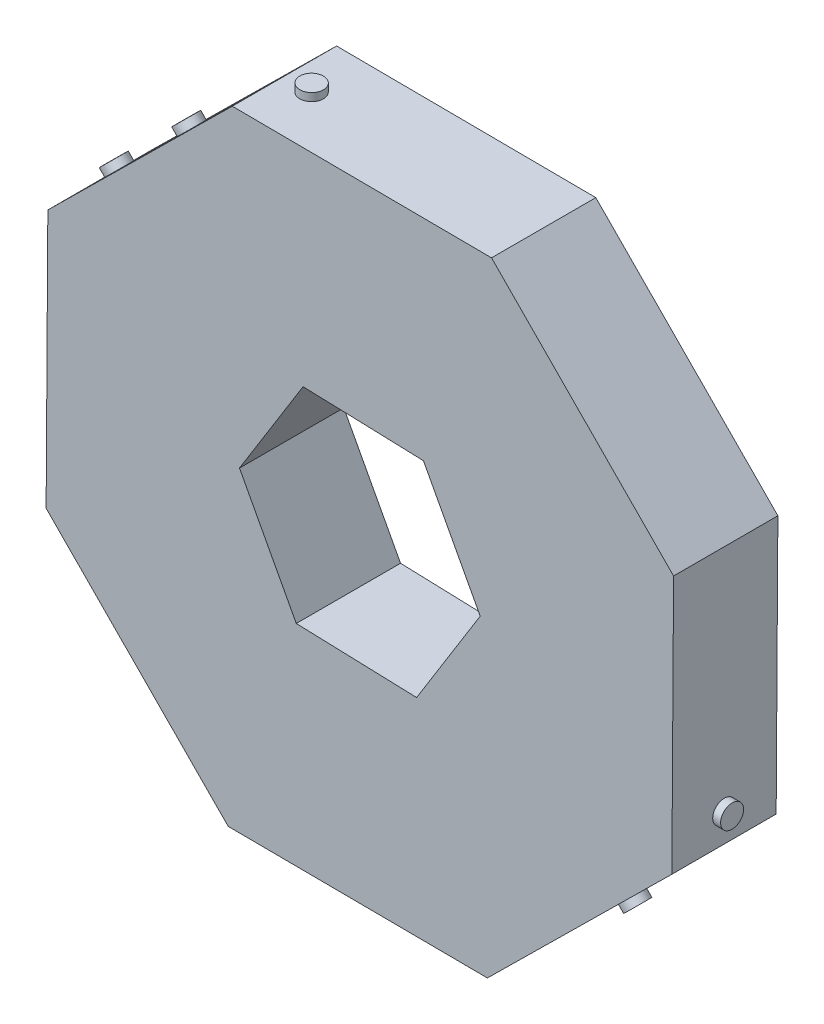
ISO-10303-21;
HEADER;
FILE_DESCRIPTION(('STEP AP214'),'2;1');
FILE_NAME('part.step','',(''),(''),'','','');
FILE_SCHEMA(('AUTOMOTIVE_DESIGN { 1 0 10303 214 1 1 1 1 }'));
ENDSEC;
DATA;
#1=APPLICATION_CONTEXT('core data for automotive mechanical design processes');
#2=APPLICATION_PROTOCOL_DEFINITION('international standard','automotive_design',2000,#1);
#3=PRODUCT_CONTEXT('',#1,'mechanical');
#4=PRODUCT('Part','Part','',(#3));
#5=PRODUCT_RELATED_PRODUCT_CATEGORY('part','',(#4));
#6=PRODUCT_DEFINITION_FORMATION('','',#4);
#7=PRODUCT_DEFINITION_CONTEXT('part definition',#1,'design');
#8=PRODUCT_DEFINITION('design','',#6,#7);
#9=PRODUCT_DEFINITION_SHAPE('','',#8);
#10=(LENGTH_UNIT() NAMED_UNIT(*) SI_UNIT(.MILLI.,.METRE.));
#11=(NAMED_UNIT(*) PLANE_ANGLE_UNIT() SI_UNIT($,.RADIAN.));
#12=(NAMED_UNIT(*) SI_UNIT($,.STERADIAN.) SOLID_ANGLE_UNIT());
#13=UNCERTAINTY_MEASURE_WITH_UNIT(LENGTH_MEASURE(1.E-05),#10,'distance_accuracy_value','');
#14=(GEOMETRIC_REPRESENTATION_CONTEXT(3) GLOBAL_UNCERTAINTY_ASSIGNED_CONTEXT((#13)) GLOBAL_UNIT_ASSIGNED_CONTEXT((#10,
#11,#12)) REPRESENTATION_CONTEXT('',''));
#15=CARTESIAN_POINT('',(0.,0.,0.));
#16=DIRECTION('',(0.,0.,1.));
#17=DIRECTION('',(1.,0.,0.));
#18=AXIS2_PLACEMENT_3D('',#15,#16,#17);
#19=CARTESIAN_POINT('',(8.01629438391465,18.9975195673597,6.35));
#20=DIRECTION('',(-0.00659830947412468,-0.999978230919095,0.));
#21=DIRECTION('',(0.999978230919095,-0.00659830947412468,0.));
#22=AXIS2_PLACEMENT_3D('',#19,#20,#21);
#23=PLANE('',#22);
#24=CARTESIAN_POINT('',(-6.11393473370306,19.0907572217161,3.175));
#25=DIRECTION('',(-0.00659830947412468,-0.999978230919095,0.));
#26=DIRECTION('',(0.999978230919095,-0.00659830947412468,0.));
#27=AXIS2_PLACEMENT_3D('',#24,#25,#26);
#28=CIRCLE('',#27,0.719999999999999);
#29=CARTESIAN_POINT('',(-5.39395040744131,19.0860064388947,3.175));
#30=VERTEX_POINT('',#29);
#31=EDGE_CURVE('E339',#30,#30,#28,.F.);
#32=ORIENTED_EDGE('',*,*,#31,.F.);
#33=EDGE_LOOP('',(#32));
#34=FACE_BOUND('',#33,.T.);
#35=DIRECTION('',(-0.999978230919096,0.00659830947412468,0.));
#36=VECTOR('',#35,1.);
#37=CARTESIAN_POINT('',(8.01629438391465,18.9975195673597,0.));
#38=LINE('',#37,#36);
#39=CARTESIAN_POINT('',(8.01629438391465,18.9975195673597,0.));
#40=VERTEX_POINT('',#39);
#41=CARTESIAN_POINT('',(-7.76489879295049,19.1016510306578,0.));
#42=VERTEX_POINT('',#41);
#43=EDGE_CURVE('E257',#40,#42,#38,.T.);
#44=ORIENTED_EDGE('',*,*,#43,.T.);
#45=DIRECTION('',(0.,0.,-1.));
#46=VECTOR('',#45,1.);
#47=CARTESIAN_POINT('',(-7.76489879295049,19.1016510306578,6.35));
#48=LINE('',#47,#46);
#49=CARTESIAN_POINT('',(-7.76489879295049,19.1016510306578,6.35));
#50=VERTEX_POINT('',#49);
#51=EDGE_CURVE('E335',#50,#42,#48,.T.);
#52=ORIENTED_EDGE('',*,*,#51,.F.);
#53=DIRECTION('',(-0.999978230919096,0.00659830947412468,0.));
#54=VECTOR('',#53,1.);
#55=CARTESIAN_POINT('',(8.01629438391465,18.9975195673597,6.35));
#56=LINE('',#55,#54);
#57=CARTESIAN_POINT('',(8.01629438391465,18.9975195673597,6.35));
#58=VERTEX_POINT('',#57);
#59=EDGE_CURVE('E258',#58,#50,#56,.T.);
#60=ORIENTED_EDGE('',*,*,#59,.F.);
#61=DIRECTION('',(0.,0.,-1.));
#62=VECTOR('',#61,1.);
#63=CARTESIAN_POINT('',(8.01629438391465,18.9975195673597,6.35));
#64=LINE('',#63,#62);
#65=EDGE_CURVE('E284',#58,#40,#64,.T.);
#66=ORIENTED_EDGE('',*,*,#65,.T.);
#67=EDGE_LOOP('',(#44,#52,#60,#66));
#68=FACE_BOUND('',#67,.T.);
#69=ADVANCED_FACE('F38',(#34,#68),#23,.F.);
#70=CARTESIAN_POINT('',(-7.76489879295049,19.1016510306578,6.35));
#71=DIRECTION('',(0.702425678748299,-0.711757097495341,0.));
#72=DIRECTION('',(0.711757097495341,0.702425678748299,0.));
#73=AXIS2_PLACEMENT_3D('',#70,#71,#72);
#74=PLANE('',#73);
#75=CARTESIAN_POINT('',(-13.4095145949238,13.5310383877675,3.175));
#76=DIRECTION('',(0.702425678748299,-0.711757097495341,0.));
#77=DIRECTION('',(0.711757097495341,0.702425678748299,0.));
#78=AXIS2_PLACEMENT_3D('',#75,#76,#77);
#79=CIRCLE('',#78,0.720000000000001);
#80=CARTESIAN_POINT('',(-12.8970494847271,14.0367848764663,3.175));
#81=VERTEX_POINT('',#80);
#82=EDGE_CURVE('E347',#81,#81,#79,.F.);
#83=ORIENTED_EDGE('',*,*,#82,.F.);
#84=EDGE_LOOP('',(#83));
#85=FACE_BOUND('',#84,.T.);
#86=CARTESIAN_POINT('',(-17.8224085993949,9.17599917952807,3.175));
#87=DIRECTION('',(0.702425678748299,-0.711757097495341,0.));
#88=DIRECTION('',(0.711757097495341,0.702425678748299,0.));
#89=AXIS2_PLACEMENT_3D('',#86,#87,#88);
#90=CIRCLE('',#89,0.719999999999999);
#91=CARTESIAN_POINT('',(-17.3099434891982,9.68174566822685,3.175));
#92=VERTEX_POINT('',#91);
#93=EDGE_CURVE('E343',#92,#92,#90,.F.);
#94=ORIENTED_EDGE('',*,*,#93,.F.);
#95=EDGE_LOOP('',(#94));
#96=FACE_BOUND('',#95,.T.);
#97=DIRECTION('',(-0.711757097495341,-0.702425678748299,0.));
#98=VECTOR('',#97,1.);
#99=CARTESIAN_POINT('',(-7.76489879295049,19.1016510306578,0.));
#100=LINE('',#99,#98);
#101=CARTESIAN_POINT('',(-18.9975195673597,8.01629438391463,0.));
#102=VERTEX_POINT('',#101);
#103=EDGE_CURVE('E288',#42,#102,#100,.T.);
#104=ORIENTED_EDGE('',*,*,#103,.T.);
#105=DIRECTION('',(0.,0.,-1.));
#106=VECTOR('',#105,1.);
#107=CARTESIAN_POINT('',(-18.9975195673597,8.01629438391463,6.35));
#108=LINE('',#107,#106);
#109=CARTESIAN_POINT('',(-18.9975195673597,8.01629438391463,6.35));
#110=VERTEX_POINT('',#109);
#111=EDGE_CURVE('E331',#110,#102,#108,.T.);
#112=ORIENTED_EDGE('',*,*,#111,.F.);
#113=DIRECTION('',(-0.711757097495341,-0.702425678748299,0.));
#114=VECTOR('',#113,1.);
#115=CARTESIAN_POINT('',(-7.76489879295049,19.1016510306578,6.35));
#116=LINE('',#115,#114);
#117=EDGE_CURVE('E262',#50,#110,#116,.T.);
#118=ORIENTED_EDGE('',*,*,#117,.F.);
#119=ORIENTED_EDGE('',*,*,#51,.T.);
#120=EDGE_LOOP('',(#104,#112,#118,#119));
#121=FACE_BOUND('',#120,.T.);
#122=ADVANCED_FACE('F424',(#85,#96,#121),#74,.F.);
#123=CARTESIAN_POINT('',(-18.9975195673597,8.01629438391463,6.35));
#124=DIRECTION('',(0.999978230919095,-0.00659830947412469,0.));
#125=DIRECTION('',(0.00659830947412469,0.999978230919095,0.));
#126=AXIS2_PLACEMENT_3D('',#123,#124,#125);
#127=PLANE('',#126);
#128=CARTESIAN_POINT('',(-19.0084103683065,6.36578618832834,3.175));
#129=DIRECTION('',(0.999978230919095,-0.00659830947412469,0.));
#130=DIRECTION('',(0.00659830947412469,0.999978230919095,0.));
#131=AXIS2_PLACEMENT_3D('',#128,#129,#130);
#132=CIRCLE('',#131,0.72);
#133=CARTESIAN_POINT('',(-19.0036595854851,7.08577051459009,3.175));
#134=VERTEX_POINT('',#133);
#135=EDGE_CURVE('E359',#134,#134,#132,.F.);
#136=ORIENTED_EDGE('',*,*,#135,.F.);
#137=EDGE_LOOP('',(#136));
#138=FACE_BOUND('',#137,.T.);
#139=CARTESIAN_POINT('',(-19.049583819425,0.125922027393186,3.175));
#140=DIRECTION('',(0.999978230919095,-0.00659830947412469,0.));
#141=DIRECTION('',(0.00659830947412469,0.999978230919095,0.));
#142=AXIS2_PLACEMENT_3D('',#139,#140,#141);
#143=CIRCLE('',#142,0.72);
#144=CARTESIAN_POINT('',(-19.0448330366036,0.845906353654935,3.175));
#145=VERTEX_POINT('',#144);
#146=EDGE_CURVE('E355',#145,#145,#143,.F.);
#147=ORIENTED_EDGE('',*,*,#146,.F.);
#148=EDGE_LOOP('',(#147));
#149=FACE_BOUND('',#148,.T.);
#150=CARTESIAN_POINT('',(-19.0907572217161,-6.11393473370306,3.175));
#151=DIRECTION('',(0.999978230919095,-0.00659830947412469,0.));
#152=DIRECTION('',(0.00659830947412469,0.999978230919095,0.));
#153=AXIS2_PLACEMENT_3D('',#150,#151,#152);
#154=CIRCLE('',#153,0.72);
#155=CARTESIAN_POINT('',(-19.0860064388947,-5.39395040744131,3.175));
#156=VERTEX_POINT('',#155);
#157=EDGE_CURVE('E351',#156,#156,#154,.F.);
#158=ORIENTED_EDGE('',*,*,#157,.F.);
#159=EDGE_LOOP('',(#158));
#160=FACE_BOUND('',#159,.T.);
#161=DIRECTION('',(-0.00659830947412468,-0.999978230919095,0.));
#162=VECTOR('',#161,1.);
#163=CARTESIAN_POINT('',(-18.9975195673597,8.01629438391463,0.));
#164=LINE('',#163,#162);
#165=CARTESIAN_POINT('',(-19.1016510306578,-7.76489879295049,0.));
#166=VERTEX_POINT('',#165);
#167=EDGE_CURVE('E291',#102,#166,#164,.T.);
#168=ORIENTED_EDGE('',*,*,#167,.T.);
#169=DIRECTION('',(0.,0.,-1.));
#170=VECTOR('',#169,1.);
#171=CARTESIAN_POINT('',(-19.1016510306578,-7.76489879295049,6.35));
#172=LINE('',#171,#170);
#173=CARTESIAN_POINT('',(-19.1016510306578,-7.76489879295049,6.35));
#174=VERTEX_POINT('',#173);
#175=EDGE_CURVE('E327',#174,#166,#172,.T.);
#176=ORIENTED_EDGE('',*,*,#175,.F.);
#177=DIRECTION('',(-0.00659830947412468,-0.999978230919095,0.));
#178=VECTOR('',#177,1.);
#179=CARTESIAN_POINT('',(-18.9975195673597,8.01629438391463,6.35));
#180=LINE('',#179,#178);
#181=EDGE_CURVE('E266',#110,#174,#180,.T.);
#182=ORIENTED_EDGE('',*,*,#181,.F.);
#183=ORIENTED_EDGE('',*,*,#111,.T.);
#184=EDGE_LOOP('',(#168,#176,#182,#183));
#185=FACE_BOUND('',#184,.T.);
#186=ADVANCED_FACE('F422',(#138,#149,#160,#185),#127,.F.);
#187=CARTESIAN_POINT('',(-19.1016510306578,-7.76489879295049,6.35));
#188=DIRECTION('',(0.711757097495341,0.702425678748299,0.));
#189=DIRECTION('',(-0.702425678748299,0.711757097495341,0.));
#190=AXIS2_PLACEMENT_3D('',#187,#188,#189);
#191=PLANE('',#190);
#192=CARTESIAN_POINT('',(-17.886077596007,-8.99662059045266,3.175));
#193=DIRECTION('',(0.711757097495341,0.702425678748299,0.));
#194=DIRECTION('',(-0.702425678748299,0.711757097495341,0.));
#195=AXIS2_PLACEMENT_3D('',#192,#193,#194);
#196=CIRCLE('',#195,0.7);
#197=CARTESIAN_POINT('',(-18.3777755711308,-8.49839062220592,3.175));
#198=VERTEX_POINT('',#197);
#199=EDGE_CURVE('E367',#198,#198,#196,.F.);
#200=ORIENTED_EDGE('',*,*,#199,.F.);
#201=EDGE_LOOP('',(#200));
#202=FACE_BOUND('',#201,.T.);
#203=CARTESIAN_POINT('',(-9.17599917952807,-17.8224085993949,3.175));
#204=DIRECTION('',(0.711757097495341,0.702425678748299,0.));
#205=DIRECTION('',(-0.702425678748299,0.711757097495341,0.));
#206=AXIS2_PLACEMENT_3D('',#203,#204,#205);
#207=CIRCLE('',#206,0.7);
#208=CARTESIAN_POINT('',(-9.66769715465188,-17.3241786311482,3.175));
#209=VERTEX_POINT('',#208);
#210=EDGE_CURVE('E363',#209,#209,#207,.F.);
#211=ORIENTED_EDGE('',*,*,#210,.F.);
#212=EDGE_LOOP('',(#211));
#213=FACE_BOUND('',#212,.T.);
#214=DIRECTION('',(0.702425678748299,-0.711757097495341,0.));
#215=VECTOR('',#214,1.);
#216=CARTESIAN_POINT('',(-19.1016510306578,-7.76489879295049,0.));
#217=LINE('',#216,#215);
#218=CARTESIAN_POINT('',(-8.01629438391464,-18.9975195673597,0.));
#219=VERTEX_POINT('',#218);
#220=EDGE_CURVE('E294',#166,#219,#217,.T.);
#221=ORIENTED_EDGE('',*,*,#220,.T.);
#222=DIRECTION('',(0.,0.,-1.));
#223=VECTOR('',#222,1.);
#224=CARTESIAN_POINT('',(-8.01629438391464,-18.9975195673597,6.35));
#225=LINE('',#224,#223);
#226=CARTESIAN_POINT('',(-8.01629438391464,-18.9975195673597,6.35));
#227=VERTEX_POINT('',#226);
#228=EDGE_CURVE('E323',#227,#219,#225,.T.);
#229=ORIENTED_EDGE('',*,*,#228,.F.);
#230=DIRECTION('',(0.702425678748299,-0.711757097495341,0.));
#231=VECTOR('',#230,1.);
#232=CARTESIAN_POINT('',(-19.1016510306578,-7.76489879295049,6.35));
#233=LINE('',#232,#231);
#234=EDGE_CURVE('E269',#174,#227,#233,.T.);
#235=ORIENTED_EDGE('',*,*,#234,.F.);
#236=ORIENTED_EDGE('',*,*,#175,.T.);
#237=EDGE_LOOP('',(#221,#229,#235,#236));
#238=FACE_BOUND('',#237,.T.);
#239=ADVANCED_FACE('F418',(#202,#213,#238),#191,.F.);
#240=CARTESIAN_POINT('',(-8.01629438391464,-18.9975195673597,6.35));
#241=DIRECTION('',(0.00659830947412468,0.999978230919095,0.));
#242=DIRECTION('',(-0.999978230919095,0.00659830947412468,0.));
#243=AXIS2_PLACEMENT_3D('',#240,#241,#242);
#244=PLANE('',#243);
#245=CARTESIAN_POINT('',(-6.28579532969371,-19.0089381842369,3.175));
#246=DIRECTION('',(0.00659830947412468,0.999978230919095,0.));
#247=DIRECTION('',(-0.999978230919095,0.00659830947412468,0.));
#248=AXIS2_PLACEMENT_3D('',#245,#246,#247);
#249=CIRCLE('',#248,0.700000000000001);
#250=CARTESIAN_POINT('',(-6.98578009133708,-19.004319367605,3.175));
#251=VERTEX_POINT('',#250);
#252=EDGE_CURVE('E375',#251,#251,#249,.F.);
#253=ORIENTED_EDGE('',*,*,#252,.F.);
#254=EDGE_LOOP('',(#253));
#255=FACE_BOUND('',#254,.T.);
#256=CARTESIAN_POINT('',(-0.0859302979953177,-19.0498477029765,3.175));
#257=DIRECTION('',(0.00659830947412468,0.999978230919095,0.));
#258=DIRECTION('',(-0.999978230919095,0.00659830947412468,0.));
#259=AXIS2_PLACEMENT_3D('',#256,#257,#258);
#260=CIRCLE('',#259,0.7);
#261=CARTESIAN_POINT('',(-0.785915059638684,-19.0452288863446,3.175));
#262=VERTEX_POINT('',#261);
#263=EDGE_CURVE('E371',#262,#262,#260,.F.);
#264=ORIENTED_EDGE('',*,*,#263,.F.);
#265=EDGE_LOOP('',(#264));
#266=FACE_BOUND('',#265,.T.);
#267=DIRECTION('',(0.999978230919096,-0.00659830947412468,0.));
#268=VECTOR('',#267,1.);
#269=CARTESIAN_POINT('',(-8.01629438391464,-18.9975195673597,0.));
#270=LINE('',#269,#268);
#271=CARTESIAN_POINT('',(7.7648987929505,-19.1016510306578,0.));
#272=VERTEX_POINT('',#271);
#273=EDGE_CURVE('E297',#219,#272,#270,.T.);
#274=ORIENTED_EDGE('',*,*,#273,.T.);
#275=DIRECTION('',(0.,0.,-1.));
#276=VECTOR('',#275,1.);
#277=CARTESIAN_POINT('',(7.7648987929505,-19.1016510306578,6.35));
#278=LINE('',#277,#276);
#279=CARTESIAN_POINT('',(7.7648987929505,-19.1016510306578,6.35));
#280=VERTEX_POINT('',#279);
#281=EDGE_CURVE('E319',#280,#272,#278,.T.);
#282=ORIENTED_EDGE('',*,*,#281,.F.);
#283=DIRECTION('',(0.999978230919096,-0.00659830947412468,0.));
#284=VECTOR('',#283,1.);
#285=CARTESIAN_POINT('',(-8.01629438391464,-18.9975195673597,6.35));
#286=LINE('',#285,#284);
#287=EDGE_CURVE('E272',#227,#280,#286,.T.);
#288=ORIENTED_EDGE('',*,*,#287,.F.);
#289=ORIENTED_EDGE('',*,*,#228,.T.);
#290=EDGE_LOOP('',(#274,#282,#288,#289));
#291=FACE_BOUND('',#290,.T.);
#292=ADVANCED_FACE('F388',(#255,#266,#291),#244,.F.);
#293=CARTESIAN_POINT('',(7.7648987929505,-19.1016510306578,6.35));
#294=DIRECTION('',(-0.702425678748299,0.711757097495341,0.));
#295=DIRECTION('',(-0.711757097495341,-0.702425678748299,0.));
#296=AXIS2_PLACEMENT_3D('',#293,#294,#295);
#297=PLANE('',#296);
#298=CARTESIAN_POINT('',(13.4095145949238,-13.5310383877675,3.175));
#299=DIRECTION('',(-0.702425678748299,0.711757097495341,0.));
#300=DIRECTION('',(-0.711757097495341,-0.702425678748299,0.));
#301=AXIS2_PLACEMENT_3D('',#298,#299,#300);
#302=CIRCLE('',#301,0.699999999999999);
#303=CARTESIAN_POINT('',(12.911284626677,-14.0227363628913,3.175));
#304=VERTEX_POINT('',#303);
#305=EDGE_CURVE('E46',#304,#304,#302,.F.);
#306=ORIENTED_EDGE('',*,*,#305,.F.);
#307=EDGE_LOOP('',(#306));
#308=FACE_BOUND('',#307,.T.);
#309=DIRECTION('',(0.71175709749534,0.702425678748299,0.));
#310=VECTOR('',#309,1.);
#311=CARTESIAN_POINT('',(7.7648987929505,-19.1016510306578,0.));
#312=LINE('',#311,#310);
#313=CARTESIAN_POINT('',(18.9975195673597,-8.01629438391464,0.));
#314=VERTEX_POINT('',#313);
#315=EDGE_CURVE('E300',#272,#314,#312,.T.);
#316=ORIENTED_EDGE('',*,*,#315,.T.);
#317=DIRECTION('',(0.,0.,-1.));
#318=VECTOR('',#317,1.);
#319=CARTESIAN_POINT('',(18.9975195673597,-8.01629438391464,6.35));
#320=LINE('',#319,#318);
#321=CARTESIAN_POINT('',(18.9975195673597,-8.01629438391464,6.35));
#322=VERTEX_POINT('',#321);
#323=EDGE_CURVE('E315',#322,#314,#320,.T.);
#324=ORIENTED_EDGE('',*,*,#323,.F.);
#325=DIRECTION('',(0.71175709749534,0.702425678748299,0.));
#326=VECTOR('',#325,1.);
#327=CARTESIAN_POINT('',(7.7648987929505,-19.1016510306578,6.35));
#328=LINE('',#327,#326);
#329=EDGE_CURVE('E275',#280,#322,#328,.T.);
#330=ORIENTED_EDGE('',*,*,#329,.F.);
#331=ORIENTED_EDGE('',*,*,#281,.T.);
#332=EDGE_LOOP('',(#316,#324,#330,#331));
#333=FACE_BOUND('',#332,.T.);
#334=ADVANCED_FACE('F384',(#308,#333),#297,.F.);
#335=CARTESIAN_POINT('',(18.9975195673597,-8.01629438391464,6.35));
#336=DIRECTION('',(-0.999978230919095,0.00659830947412468,0.));
#337=DIRECTION('',(-0.00659830947412468,-0.999978230919095,0.));
#338=AXIS2_PLACEMENT_3D('',#335,#336,#337);
#339=PLANE('',#338);
#340=CARTESIAN_POINT('',(19.0089381842369,-6.28579532969372,3.175));
#341=DIRECTION('',(-0.999978230919095,0.00659830947412468,0.));
#342=DIRECTION('',(-0.00659830947412468,-0.999978230919095,0.));
#343=AXIS2_PLACEMENT_3D('',#340,#341,#342);
#344=CIRCLE('',#343,0.7);
#345=CARTESIAN_POINT('',(19.004319367605,-6.98578009133708,3.175));
#346=VERTEX_POINT('',#345);
#347=EDGE_CURVE('E11',#346,#346,#344,.F.);
#348=ORIENTED_EDGE('',*,*,#347,.F.);
#349=EDGE_LOOP('',(#348));
#350=FACE_BOUND('',#349,.T.);
#351=DIRECTION('',(0.00659830947412468,0.999978230919096,0.));
#352=VECTOR('',#351,1.);
#353=CARTESIAN_POINT('',(18.9975195673597,-8.01629438391464,0.));
#354=LINE('',#353,#352);
#355=CARTESIAN_POINT('',(19.1016510306579,7.76489879295049,0.));
#356=VERTEX_POINT('',#355);
#357=EDGE_CURVE('E303',#314,#356,#354,.T.);
#358=ORIENTED_EDGE('',*,*,#357,.T.);
#359=DIRECTION('',(0.,0.,-1.));
#360=VECTOR('',#359,1.);
#361=CARTESIAN_POINT('',(19.1016510306579,7.76489879295049,6.35));
#362=LINE('',#361,#360);
#363=CARTESIAN_POINT('',(19.1016510306579,7.76489879295049,6.35));
#364=VERTEX_POINT('',#363);
#365=EDGE_CURVE('E311',#364,#356,#362,.T.);
#366=ORIENTED_EDGE('',*,*,#365,.F.);
#367=DIRECTION('',(0.00659830947412468,0.999978230919096,0.));
#368=VECTOR('',#367,1.);
#369=CARTESIAN_POINT('',(18.9975195673597,-8.01629438391464,6.35));
#370=LINE('',#369,#368);
#371=EDGE_CURVE('E278',#322,#364,#370,.T.);
#372=ORIENTED_EDGE('',*,*,#371,.F.);
#373=ORIENTED_EDGE('',*,*,#323,.T.);
#374=EDGE_LOOP('',(#358,#366,#372,#373));
#375=FACE_BOUND('',#374,.T.);
#376=ADVANCED_FACE('F387',(#350,#375),#339,.F.);
#377=CARTESIAN_POINT('',(19.1016510306579,7.76489879295049,6.35));
#378=DIRECTION('',(-0.711757097495341,-0.702425678748299,0.));
#379=DIRECTION('',(0.702425678748299,-0.711757097495341,0.));
#380=AXIS2_PLACEMENT_3D('',#377,#378,#379);
#381=PLANE('',#380);
#382=DIRECTION('',(-0.702425678748299,0.711757097495341,0.));
#383=VECTOR('',#382,1.);
#384=CARTESIAN_POINT('',(19.1016510306579,7.76489879295049,0.));
#385=LINE('',#384,#383);
#386=EDGE_CURVE('E263',#356,#40,#385,.T.);
#387=ORIENTED_EDGE('',*,*,#386,.T.);
#388=ORIENTED_EDGE('',*,*,#65,.F.);
#389=DIRECTION('',(-0.702425678748299,0.711757097495341,0.));
#390=VECTOR('',#389,1.);
#391=CARTESIAN_POINT('',(19.1016510306579,7.76489879295049,6.35));
#392=LINE('',#391,#390);
#393=EDGE_CURVE('E281',#364,#58,#392,.T.);
#394=ORIENTED_EDGE('',*,*,#393,.F.);
#395=ORIENTED_EDGE('',*,*,#365,.T.);
#396=EDGE_LOOP('',(#387,#388,#394,#395));
#397=FACE_BOUND('',#396,.T.);
#398=ADVANCED_FACE('F405',(#397),#381,.F.);
#399=CARTESIAN_POINT('',(0.,0.,6.35));
#400=DIRECTION('',(0.,0.,1.));
#401=DIRECTION('',(1.,0.,0.));
#402=AXIS2_PLACEMENT_3D('',#399,#400,#401);
#403=PLANE('',#402);
#404=DIRECTION('',(0.999462830026054,-0.0327727233581773,0.));
#405=VECTOR('',#404,1.);
#406=CARTESIAN_POINT('',(-3.45609805732518,6.46673948381149,6.35));
#407=LINE('',#406,#405);
#408=CARTESIAN_POINT('',(-3.45609805732518,6.46673948381149,6.35));
#409=VERTEX_POINT('',#408);
#410=CARTESIAN_POINT('',(3.87231164397403,6.2264384575194,6.35));
#411=VERTEX_POINT('',#410);
#412=EDGE_CURVE('E141',#409,#411,#407,.T.);
#413=ORIENTED_EDGE('',*,*,#412,.T.);
#414=DIRECTION('',(0.471349404033646,-0.88194656261994,0.));
#415=VECTOR('',#414,1.);
#416=CARTESIAN_POINT('',(3.87231164397403,6.2264384575194,6.35));
#417=LINE('',#416,#415);
#418=CARTESIAN_POINT('',(7.3284097012992,-0.240301026292095,6.35));
#419=VERTEX_POINT('',#418);
#420=EDGE_CURVE('E151',#411,#419,#417,.T.);
#421=ORIENTED_EDGE('',*,*,#420,.T.);
#422=DIRECTION('',(-0.528113425992408,-0.849173839261762,0.));
#423=VECTOR('',#422,1.);
#424=CARTESIAN_POINT('',(7.3284097012992,-0.240301026292095,6.35));
#425=LINE('',#424,#423);
#426=CARTESIAN_POINT('',(3.45609805732518,-6.46673948381149,6.35));
#427=VERTEX_POINT('',#426);
#428=EDGE_CURVE('E53',#419,#427,#425,.T.);
#429=ORIENTED_EDGE('',*,*,#428,.T.);
#430=DIRECTION('',(-0.999462830026054,0.0327727233581772,0.));
#431=VECTOR('',#430,1.);
#432=CARTESIAN_POINT('',(3.45609805732518,-6.46673948381149,6.35));
#433=LINE('',#432,#431);
#434=CARTESIAN_POINT('',(-3.87231164397403,-6.22643845751939,6.35));
#435=VERTEX_POINT('',#434);
#436=EDGE_CURVE('E170',#427,#435,#433,.T.);
#437=ORIENTED_EDGE('',*,*,#436,.T.);
#438=DIRECTION('',(-0.471349404033646,0.88194656261994,0.));
#439=VECTOR('',#438,1.);
#440=CARTESIAN_POINT('',(-3.87231164397403,-6.22643845751939,6.35));
#441=LINE('',#440,#439);
#442=CARTESIAN_POINT('',(-7.32840970129921,0.240301026292096,6.35));
#443=VERTEX_POINT('',#442);
#444=EDGE_CURVE('E174',#435,#443,#441,.T.);
#445=ORIENTED_EDGE('',*,*,#444,.T.);
#446=DIRECTION('',(0.528113425992408,0.849173839261762,0.));
#447=VECTOR('',#446,1.);
#448=CARTESIAN_POINT('',(-7.32840970129921,0.240301026292096,6.35));
#449=LINE('',#448,#447);
#450=EDGE_CURVE('E148',#443,#409,#449,.T.);
#451=ORIENTED_EDGE('',*,*,#450,.T.);
#452=EDGE_LOOP('',(#413,#421,#429,#437,#445,#451));
#453=FACE_BOUND('',#452,.T.);
#454=ORIENTED_EDGE('',*,*,#59,.T.);
#455=ORIENTED_EDGE('',*,*,#117,.T.);
#456=ORIENTED_EDGE('',*,*,#181,.T.);
#457=ORIENTED_EDGE('',*,*,#234,.T.);
#458=ORIENTED_EDGE('',*,*,#287,.T.);
#459=ORIENTED_EDGE('',*,*,#329,.T.);
#460=ORIENTED_EDGE('',*,*,#371,.T.);
#461=ORIENTED_EDGE('',*,*,#393,.T.);
#462=EDGE_LOOP('',(#454,#455,#456,#457,#458,#459,#460,#461));
#463=FACE_BOUND('',#462,.T.);
#464=ADVANCED_FACE('F156',(#453,#463),#403,.T.);
#465=CARTESIAN_POINT('',(0.,0.,0.));
#466=DIRECTION('',(0.,0.,1.));
#467=DIRECTION('',(1.,0.,0.));
#468=AXIS2_PLACEMENT_3D('',#465,#466,#467);
#469=PLANE('',#468);
#470=DIRECTION('',(0.471349404033646,-0.88194656261994,0.));
#471=VECTOR('',#470,1.);
#472=CARTESIAN_POINT('',(3.87231164397403,6.2264384575194,0.));
#473=LINE('',#472,#471);
#474=CARTESIAN_POINT('',(3.87231164397403,6.22643845751939,0.));
#475=VERTEX_POINT('',#474);
#476=CARTESIAN_POINT('',(7.3284097012992,-0.240301026292095,0.));
#477=VERTEX_POINT('',#476);
#478=EDGE_CURVE('E181',#475,#477,#473,.T.);
#479=ORIENTED_EDGE('',*,*,#478,.F.);
#480=DIRECTION('',(0.999462830026054,-0.0327727233581773,0.));
#481=VECTOR('',#480,1.);
#482=CARTESIAN_POINT('',(-3.45609805732518,6.46673948381149,0.));
#483=LINE('',#482,#481);
#484=CARTESIAN_POINT('',(-3.45609805732518,6.46673948381149,0.));
#485=VERTEX_POINT('',#484);
#486=EDGE_CURVE('E61',#485,#475,#483,.T.);
#487=ORIENTED_EDGE('',*,*,#486,.F.);
#488=DIRECTION('',(0.528113425992408,0.849173839261762,0.));
#489=VECTOR('',#488,1.);
#490=CARTESIAN_POINT('',(-7.32840970129921,0.240301026292096,0.));
#491=LINE('',#490,#489);
#492=CARTESIAN_POINT('',(-7.32840970129921,0.240301026292096,0.));
#493=VERTEX_POINT('',#492);
#494=EDGE_CURVE('E161',#493,#485,#491,.T.);
#495=ORIENTED_EDGE('',*,*,#494,.F.);
#496=DIRECTION('',(-0.471349404033646,0.88194656261994,0.));
#497=VECTOR('',#496,1.);
#498=CARTESIAN_POINT('',(-3.87231164397403,-6.22643845751939,0.));
#499=LINE('',#498,#497);
#500=CARTESIAN_POINT('',(-3.87231164397403,-6.22643845751939,0.));
#501=VERTEX_POINT('',#500);
#502=EDGE_CURVE('E165',#501,#493,#499,.T.);
#503=ORIENTED_EDGE('',*,*,#502,.F.);
#504=DIRECTION('',(-0.999462830026054,0.0327727233581772,0.));
#505=VECTOR('',#504,1.);
#506=CARTESIAN_POINT('',(3.45609805732518,-6.46673948381149,0.));
#507=LINE('',#506,#505);
#508=CARTESIAN_POINT('',(3.45609805732518,-6.46673948381149,0.));
#509=VERTEX_POINT('',#508);
#510=EDGE_CURVE('E188',#509,#501,#507,.T.);
#511=ORIENTED_EDGE('',*,*,#510,.F.);
#512=DIRECTION('',(-0.528113425992408,-0.849173839261762,0.));
#513=VECTOR('',#512,1.);
#514=CARTESIAN_POINT('',(7.3284097012992,-0.240301026292095,0.));
#515=LINE('',#514,#513);
#516=EDGE_CURVE('E184',#477,#509,#515,.T.);
#517=ORIENTED_EDGE('',*,*,#516,.F.);
#518=EDGE_LOOP('',(#479,#487,#495,#503,#511,#517));
#519=FACE_BOUND('',#518,.T.);
#520=ORIENTED_EDGE('',*,*,#43,.F.);
#521=ORIENTED_EDGE('',*,*,#386,.F.);
#522=ORIENTED_EDGE('',*,*,#357,.F.);
#523=ORIENTED_EDGE('',*,*,#315,.F.);
#524=ORIENTED_EDGE('',*,*,#273,.F.);
#525=ORIENTED_EDGE('',*,*,#220,.F.);
#526=ORIENTED_EDGE('',*,*,#167,.F.);
#527=ORIENTED_EDGE('',*,*,#103,.F.);
#528=EDGE_LOOP('',(#520,#521,#522,#523,#524,#525,#526,#527));
#529=FACE_BOUND('',#528,.T.);
#530=ADVANCED_FACE('F402',(#519,#529),#469,.F.);
#531=CARTESIAN_POINT('',(-6.11076754515548,19.5707467725572,3.175));
#532=DIRECTION('',(-0.00659830947412468,-0.999978230919096,0.));
#533=DIRECTION('',(0.999978230919095,-0.00659830947412468,0.));
#534=AXIS2_PLACEMENT_3D('',#531,#532,#533);
#535=CYLINDRICAL_SURFACE('',#534,0.719999999999999);
#536=CARTESIAN_POINT('',(-6.11076754515548,19.5707467725572,3.175));
#537=DIRECTION('',(0.00659830947412468,0.999978230919095,0.));
#538=DIRECTION('',(-0.999978230919096,0.00659830947412468,0.));
#539=AXIS2_PLACEMENT_3D('',#536,#537,#538);
#540=CIRCLE('',#539,0.719999999999999);
#541=CARTESIAN_POINT('',(-6.83075187141723,19.5754975553786,3.175));
#542=VERTEX_POINT('',#541);
#543=EDGE_CURVE('E253',#542,#542,#540,.T.);
#544=ORIENTED_EDGE('',*,*,#543,.F.);
#545=EDGE_LOOP('',(#544));
#546=FACE_BOUND('',#545,.T.);
#547=ORIENTED_EDGE('',*,*,#31,.T.);
#548=EDGE_LOOP('',(#547));
#549=FACE_BOUND('',#548,.T.);
#550=ADVANCED_FACE('F450',(#546,#549),#535,.T.);
#551=CARTESIAN_POINT('',(-6.11076754515548,19.5707467725572,3.175));
#552=DIRECTION('',(0.00659830947412468,0.999978230919095,0.));
#553=DIRECTION('',(-0.999978230919096,0.00659830947412468,0.));
#554=AXIS2_PLACEMENT_3D('',#551,#552,#553);
#555=PLANE('',#554);
#556=ORIENTED_EDGE('',*,*,#543,.T.);
#557=EDGE_LOOP('',(#556));
#558=FACE_BOUND('',#557,.T.);
#559=ADVANCED_FACE('F456',(#558),#555,.T.);
#560=CARTESIAN_POINT('',(-18.1595729251941,9.51764258632584,3.175));
#561=DIRECTION('',(0.702425678748299,-0.711757097495341,0.));
#562=DIRECTION('',(0.711757097495341,0.702425678748299,0.));
#563=AXIS2_PLACEMENT_3D('',#560,#561,#562);
#564=CYLINDRICAL_SURFACE('',#563,0.719999999999999);
#565=CARTESIAN_POINT('',(-18.1595729251941,9.51764258632584,3.175));
#566=DIRECTION('',(-0.702425678748299,0.711757097495341,0.));
#567=DIRECTION('',(-0.711757097495341,-0.702425678748299,0.));
#568=AXIS2_PLACEMENT_3D('',#565,#566,#567);
#569=CIRCLE('',#568,0.719999999999999);
#570=CARTESIAN_POINT('',(-18.6720380353907,9.01189609762706,3.175));
#571=VERTEX_POINT('',#570);
#572=EDGE_CURVE('E249',#571,#571,#569,.T.);
#573=ORIENTED_EDGE('',*,*,#572,.F.);
#574=EDGE_LOOP('',(#573));
#575=FACE_BOUND('',#574,.T.);
#576=ORIENTED_EDGE('',*,*,#93,.T.);
#577=EDGE_LOOP('',(#576));
#578=FACE_BOUND('',#577,.T.);
#579=ADVANCED_FACE('F460',(#575,#578),#564,.T.);
#580=CARTESIAN_POINT('',(-18.1595729251941,9.51764258632584,3.175));
#581=DIRECTION('',(-0.702425678748299,0.711757097495341,0.));
#582=DIRECTION('',(-0.711757097495341,-0.702425678748299,0.));
#583=AXIS2_PLACEMENT_3D('',#580,#581,#582);
#584=PLANE('',#583);
#585=ORIENTED_EDGE('',*,*,#572,.T.);
#586=EDGE_LOOP('',(#585));
#587=FACE_BOUND('',#586,.T.);
#588=ADVANCED_FACE('F464',(#587),#584,.T.);
#589=CARTESIAN_POINT('',(-13.746678920723,13.8726817945653,3.175));
#590=DIRECTION('',(0.702425678748299,-0.711757097495341,0.));
#591=DIRECTION('',(0.711757097495341,0.702425678748299,0.));
#592=AXIS2_PLACEMENT_3D('',#589,#590,#591);
#593=CYLINDRICAL_SURFACE('',#592,0.720000000000001);
#594=CARTESIAN_POINT('',(-13.746678920723,13.8726817945653,3.175));
#595=DIRECTION('',(-0.702425678748299,0.711757097495341,0.));
#596=DIRECTION('',(-0.711757097495341,-0.702425678748299,0.));
#597=AXIS2_PLACEMENT_3D('',#594,#595,#596);
#598=CIRCLE('',#597,0.720000000000001);
#599=CARTESIAN_POINT('',(-14.2591440309196,13.3669353058665,3.175));
#600=VERTEX_POINT('',#599);
#601=EDGE_CURVE('E245',#600,#600,#598,.T.);
#602=ORIENTED_EDGE('',*,*,#601,.F.);
#603=EDGE_LOOP('',(#602));
#604=FACE_BOUND('',#603,.T.);
#605=ORIENTED_EDGE('',*,*,#82,.T.);
#606=EDGE_LOOP('',(#605));
#607=FACE_BOUND('',#606,.T.);
#608=ADVANCED_FACE('F468',(#604,#607),#593,.T.);
#609=CARTESIAN_POINT('',(-13.746678920723,13.8726817945653,3.175));
#610=DIRECTION('',(-0.702425678748299,0.711757097495341,0.));
#611=DIRECTION('',(-0.711757097495341,-0.702425678748299,0.));
#612=AXIS2_PLACEMENT_3D('',#609,#610,#611);
#613=PLANE('',#612);
#614=ORIENTED_EDGE('',*,*,#601,.T.);
#615=EDGE_LOOP('',(#614));
#616=FACE_BOUND('',#615,.T.);
#617=ADVANCED_FACE('F472',(#616),#613,.T.);
#618=CARTESIAN_POINT('',(-19.5707467725572,-6.11076754515548,3.175));
#619=DIRECTION('',(0.999978230919096,-0.00659830947412469,0.));
#620=DIRECTION('',(0.00659830947412469,0.999978230919095,0.));
#621=AXIS2_PLACEMENT_3D('',#618,#619,#620);
#622=CYLINDRICAL_SURFACE('',#621,0.72);
#623=CARTESIAN_POINT('',(-19.5707467725572,-6.11076754515548,3.175));
#624=DIRECTION('',(-0.999978230919095,0.00659830947412469,0.));
#625=DIRECTION('',(-0.00659830947412469,-0.999978230919096,0.));
#626=AXIS2_PLACEMENT_3D('',#623,#624,#625);
#627=CIRCLE('',#626,0.72);
#628=CARTESIAN_POINT('',(-19.5754975553786,-6.83075187141723,3.175));
#629=VERTEX_POINT('',#628);
#630=EDGE_CURVE('E241',#629,#629,#627,.T.);
#631=ORIENTED_EDGE('',*,*,#630,.F.);
#632=EDGE_LOOP('',(#631));
#633=FACE_BOUND('',#632,.T.);
#634=ORIENTED_EDGE('',*,*,#157,.T.);
#635=EDGE_LOOP('',(#634));
#636=FACE_BOUND('',#635,.T.);
#637=ADVANCED_FACE('F476',(#633,#636),#622,.T.);
#638=CARTESIAN_POINT('',(-19.5707467725572,-6.11076754515548,3.175));
#639=DIRECTION('',(-0.999978230919095,0.00659830947412469,0.));
#640=DIRECTION('',(-0.00659830947412469,-0.999978230919096,0.));
#641=AXIS2_PLACEMENT_3D('',#638,#639,#640);
#642=PLANE('',#641);
#643=ORIENTED_EDGE('',*,*,#630,.T.);
#644=EDGE_LOOP('',(#643));
#645=FACE_BOUND('',#644,.T.);
#646=ADVANCED_FACE('F480',(#645),#642,.T.);
#647=CARTESIAN_POINT('',(-19.5295733702662,0.129089215940766,3.175));
#648=DIRECTION('',(0.999978230919096,-0.00659830947412469,0.));
#649=DIRECTION('',(0.00659830947412469,0.999978230919095,0.));
#650=AXIS2_PLACEMENT_3D('',#647,#648,#649);
#651=CYLINDRICAL_SURFACE('',#650,0.72);
#652=CARTESIAN_POINT('',(-19.5295733702662,0.129089215940766,3.175));
#653=DIRECTION('',(-0.999978230919095,0.00659830947412469,0.));
#654=DIRECTION('',(-0.00659830947412469,-0.999978230919096,0.));
#655=AXIS2_PLACEMENT_3D('',#652,#653,#654);
#656=CIRCLE('',#655,0.72);
#657=CARTESIAN_POINT('',(-19.5343241530876,-0.590895110320983,3.175));
#658=VERTEX_POINT('',#657);
#659=EDGE_CURVE('E237',#658,#658,#656,.T.);
#660=ORIENTED_EDGE('',*,*,#659,.F.);
#661=EDGE_LOOP('',(#660));
#662=FACE_BOUND('',#661,.T.);
#663=ORIENTED_EDGE('',*,*,#146,.T.);
#664=EDGE_LOOP('',(#663));
#665=FACE_BOUND('',#664,.T.);
#666=ADVANCED_FACE('F484',(#662,#665),#651,.T.);
#667=CARTESIAN_POINT('',(-19.5295733702662,0.129089215940766,3.175));
#668=DIRECTION('',(-0.999978230919095,0.00659830947412469,0.));
#669=DIRECTION('',(-0.00659830947412469,-0.999978230919096,0.));
#670=AXIS2_PLACEMENT_3D('',#667,#668,#669);
#671=PLANE('',#670);
#672=ORIENTED_EDGE('',*,*,#659,.T.);
#673=EDGE_LOOP('',(#672));
#674=FACE_BOUND('',#673,.T.);
#675=ADVANCED_FACE('F488',(#674),#671,.T.);
#676=CARTESIAN_POINT('',(-19.4883999191476,6.36895337687592,3.175));
#677=DIRECTION('',(0.999978230919096,-0.00659830947412469,0.));
#678=DIRECTION('',(0.00659830947412469,0.999978230919095,0.));
#679=AXIS2_PLACEMENT_3D('',#676,#677,#678);
#680=CYLINDRICAL_SURFACE('',#679,0.72);
#681=CARTESIAN_POINT('',(-19.4883999191476,6.36895337687592,3.175));
#682=DIRECTION('',(-0.999978230919095,0.00659830947412469,0.));
#683=DIRECTION('',(-0.00659830947412469,-0.999978230919096,0.));
#684=AXIS2_PLACEMENT_3D('',#681,#682,#683);
#685=CIRCLE('',#684,0.72);
#686=CARTESIAN_POINT('',(-19.493150701969,5.64896905061417,3.175));
#687=VERTEX_POINT('',#686);
#688=EDGE_CURVE('E233',#687,#687,#685,.T.);
#689=ORIENTED_EDGE('',*,*,#688,.F.);
#690=EDGE_LOOP('',(#689));
#691=FACE_BOUND('',#690,.T.);
#692=ORIENTED_EDGE('',*,*,#135,.T.);
#693=EDGE_LOOP('',(#692));
#694=FACE_BOUND('',#693,.T.);
#695=ADVANCED_FACE('F492',(#691,#694),#680,.T.);
#696=CARTESIAN_POINT('',(-19.4883999191476,6.36895337687592,3.175));
#697=DIRECTION('',(-0.999978230919095,0.00659830947412469,0.));
#698=DIRECTION('',(-0.00659830947412469,-0.999978230919096,0.));
#699=AXIS2_PLACEMENT_3D('',#696,#697,#698);
#700=PLANE('',#699);
#701=ORIENTED_EDGE('',*,*,#688,.T.);
#702=EDGE_LOOP('',(#701));
#703=FACE_BOUND('',#702,.T.);
#704=ADVANCED_FACE('F496',(#703),#700,.T.);
#705=CARTESIAN_POINT('',(-9.51764258632584,-18.1595729251941,3.175));
#706=DIRECTION('',(0.711757097495341,0.702425678748299,0.));
#707=DIRECTION('',(-0.702425678748299,0.711757097495341,0.));
#708=AXIS2_PLACEMENT_3D('',#705,#706,#707);
#709=CYLINDRICAL_SURFACE('',#708,0.7);
#710=CARTESIAN_POINT('',(-9.51764258632584,-18.1595729251941,3.175));
#711=DIRECTION('',(-0.711757097495341,-0.702425678748299,0.));
#712=DIRECTION('',(0.702425678748299,-0.711757097495341,0.));
#713=AXIS2_PLACEMENT_3D('',#710,#711,#712);
#714=CIRCLE('',#713,0.7);
#715=CARTESIAN_POINT('',(-9.02594461120203,-18.6578028934408,3.175));
#716=VERTEX_POINT('',#715);
#717=EDGE_CURVE('E229',#716,#716,#714,.T.);
#718=ORIENTED_EDGE('',*,*,#717,.F.);
#719=EDGE_LOOP('',(#718));
#720=FACE_BOUND('',#719,.T.);
#721=ORIENTED_EDGE('',*,*,#210,.T.);
#722=EDGE_LOOP('',(#721));
#723=FACE_BOUND('',#722,.T.);
#724=ADVANCED_FACE('F500',(#720,#723),#709,.T.);
#725=CARTESIAN_POINT('',(-9.51764258632584,-18.1595729251941,3.175));
#726=DIRECTION('',(-0.711757097495341,-0.702425678748299,0.));
#727=DIRECTION('',(0.702425678748299,-0.711757097495341,0.));
#728=AXIS2_PLACEMENT_3D('',#725,#726,#727);
#729=PLANE('',#728);
#730=ORIENTED_EDGE('',*,*,#717,.T.);
#731=EDGE_LOOP('',(#730));
#732=FACE_BOUND('',#731,.T.);
#733=ADVANCED_FACE('F504',(#732),#729,.T.);
#734=CARTESIAN_POINT('',(-18.2277210028048,-9.33378491625185,3.175));
#735=DIRECTION('',(0.711757097495341,0.702425678748299,0.));
#736=DIRECTION('',(-0.702425678748299,0.711757097495341,0.));
#737=AXIS2_PLACEMENT_3D('',#734,#735,#736);
#738=CYLINDRICAL_SURFACE('',#737,0.7);
#739=CARTESIAN_POINT('',(-18.2277210028048,-9.33378491625185,3.175));
#740=DIRECTION('',(-0.711757097495341,-0.702425678748299,0.));
#741=DIRECTION('',(0.702425678748299,-0.711757097495341,0.));
#742=AXIS2_PLACEMENT_3D('',#739,#740,#741);
#743=CIRCLE('',#742,0.7);
#744=CARTESIAN_POINT('',(-17.7360230276809,-9.83201488449859,3.175));
#745=VERTEX_POINT('',#744);
#746=EDGE_CURVE('E225',#745,#745,#743,.T.);
#747=ORIENTED_EDGE('',*,*,#746,.F.);
#748=EDGE_LOOP('',(#747));
#749=FACE_BOUND('',#748,.T.);
#750=ORIENTED_EDGE('',*,*,#199,.T.);
#751=EDGE_LOOP('',(#750));
#752=FACE_BOUND('',#751,.T.);
#753=ADVANCED_FACE('F508',(#749,#752),#738,.T.);
#754=CARTESIAN_POINT('',(-18.2277210028048,-9.33378491625185,3.175));
#755=DIRECTION('',(-0.711757097495341,-0.702425678748299,0.));
#756=DIRECTION('',(0.702425678748299,-0.711757097495341,0.));
#757=AXIS2_PLACEMENT_3D('',#754,#755,#756);
#758=PLANE('',#757);
#759=ORIENTED_EDGE('',*,*,#746,.T.);
#760=EDGE_LOOP('',(#759));
#761=FACE_BOUND('',#760,.T.);
#762=ADVANCED_FACE('F512',(#761),#758,.T.);
#763=CARTESIAN_POINT('',(-0.0890974865428976,-19.5298372538177,3.175));
#764=DIRECTION('',(0.00659830947412468,0.999978230919096,0.));
#765=DIRECTION('',(-0.999978230919095,0.00659830947412468,0.));
#766=AXIS2_PLACEMENT_3D('',#763,#764,#765);
#767=CYLINDRICAL_SURFACE('',#766,0.7);
#768=CARTESIAN_POINT('',(-0.0890974865428976,-19.5298372538177,3.175));
#769=DIRECTION('',(-0.00659830947412468,-0.999978230919095,0.));
#770=DIRECTION('',(0.999978230919096,-0.00659830947412468,0.));
#771=AXIS2_PLACEMENT_3D('',#768,#769,#770);
#772=CIRCLE('',#771,0.7);
#773=CARTESIAN_POINT('',(0.610887275100469,-19.5344560704496,3.175));
#774=VERTEX_POINT('',#773);
#775=EDGE_CURVE('E221',#774,#774,#772,.T.);
#776=ORIENTED_EDGE('',*,*,#775,.F.);
#777=EDGE_LOOP('',(#776));
#778=FACE_BOUND('',#777,.T.);
#779=ORIENTED_EDGE('',*,*,#263,.T.);
#780=EDGE_LOOP('',(#779));
#781=FACE_BOUND('',#780,.T.);
#782=ADVANCED_FACE('F516',(#778,#781),#767,.T.);
#783=CARTESIAN_POINT('',(-0.0890974865428976,-19.5298372538177,3.175));
#784=DIRECTION('',(-0.00659830947412468,-0.999978230919095,0.));
#785=DIRECTION('',(0.999978230919096,-0.00659830947412468,0.));
#786=AXIS2_PLACEMENT_3D('',#783,#784,#785);
#787=PLANE('',#786);
#788=ORIENTED_EDGE('',*,*,#775,.T.);
#789=EDGE_LOOP('',(#788));
#790=FACE_BOUND('',#789,.T.);
#791=ADVANCED_FACE('F520',(#790),#787,.T.);
#792=CARTESIAN_POINT('',(-6.28896251824129,-19.4889277350781,3.175));
#793=DIRECTION('',(0.00659830947412468,0.999978230919096,0.));
#794=DIRECTION('',(-0.999978230919095,0.00659830947412468,0.));
#795=AXIS2_PLACEMENT_3D('',#792,#793,#794);
#796=CYLINDRICAL_SURFACE('',#795,0.700000000000001);
#797=CARTESIAN_POINT('',(-6.28896251824129,-19.4889277350781,3.175));
#798=DIRECTION('',(-0.00659830947412468,-0.999978230919095,0.));
#799=DIRECTION('',(0.999978230919096,-0.00659830947412468,0.));
#800=AXIS2_PLACEMENT_3D('',#797,#798,#799);
#801=CIRCLE('',#800,0.700000000000001);
#802=CARTESIAN_POINT('',(-5.58897775659792,-19.49354655171,3.175));
#803=VERTEX_POINT('',#802);
#804=EDGE_CURVE('E217',#803,#803,#801,.T.);
#805=ORIENTED_EDGE('',*,*,#804,.F.);
#806=EDGE_LOOP('',(#805));
#807=FACE_BOUND('',#806,.T.);
#808=ORIENTED_EDGE('',*,*,#252,.T.);
#809=EDGE_LOOP('',(#808));
#810=FACE_BOUND('',#809,.T.);
#811=ADVANCED_FACE('F524',(#807,#810),#796,.T.);
#812=CARTESIAN_POINT('',(-6.28896251824129,-19.4889277350781,3.175));
#813=DIRECTION('',(-0.00659830947412468,-0.999978230919095,0.));
#814=DIRECTION('',(0.999978230919096,-0.00659830947412468,0.));
#815=AXIS2_PLACEMENT_3D('',#812,#813,#814);
#816=PLANE('',#815);
#817=ORIENTED_EDGE('',*,*,#804,.T.);
#818=EDGE_LOOP('',(#817));
#819=FACE_BOUND('',#818,.T.);
#820=ADVANCED_FACE('F528',(#819),#816,.T.);
#821=CARTESIAN_POINT('',(13.746678920723,-13.8726817945653,3.175));
#822=DIRECTION('',(-0.702425678748299,0.71175709749534,0.));
#823=DIRECTION('',(-0.71175709749534,-0.702425678748299,0.));
#824=AXIS2_PLACEMENT_3D('',#821,#822,#823);
#825=CYLINDRICAL_SURFACE('',#824,0.699999999999999);
#826=CARTESIAN_POINT('',(13.746678920723,-13.8726817945653,3.175));
#827=DIRECTION('',(0.702425678748299,-0.71175709749534,0.));
#828=DIRECTION('',(0.71175709749534,0.702425678748299,0.));
#829=AXIS2_PLACEMENT_3D('',#826,#827,#828);
#830=CIRCLE('',#829,0.699999999999999);
#831=CARTESIAN_POINT('',(14.2449088889697,-13.3809838194415,3.175));
#832=VERTEX_POINT('',#831);
#833=EDGE_CURVE('E213',#832,#832,#830,.T.);
#834=ORIENTED_EDGE('',*,*,#833,.F.);
#835=EDGE_LOOP('',(#834));
#836=FACE_BOUND('',#835,.T.);
#837=ORIENTED_EDGE('',*,*,#305,.T.);
#838=EDGE_LOOP('',(#837));
#839=FACE_BOUND('',#838,.T.);
#840=ADVANCED_FACE('F382',(#836,#839),#825,.T.);
#841=CARTESIAN_POINT('',(13.746678920723,-13.8726817945653,3.175));
#842=DIRECTION('',(0.702425678748299,-0.71175709749534,0.));
#843=DIRECTION('',(0.71175709749534,0.702425678748299,0.));
#844=AXIS2_PLACEMENT_3D('',#841,#842,#843);
#845=PLANE('',#844);
#846=ORIENTED_EDGE('',*,*,#833,.T.);
#847=EDGE_LOOP('',(#846));
#848=FACE_BOUND('',#847,.T.);
#849=ADVANCED_FACE('F535',(#848),#845,.T.);
#850=CARTESIAN_POINT('',(19.4889277350781,-6.2889625182413,3.175));
#851=DIRECTION('',(-0.999978230919096,0.00659830947412468,0.));
#852=DIRECTION('',(-0.00659830947412468,-0.999978230919095,0.));
#853=AXIS2_PLACEMENT_3D('',#850,#851,#852);
#854=CYLINDRICAL_SURFACE('',#853,0.7);
#855=CARTESIAN_POINT('',(19.4889277350781,-6.2889625182413,3.175));
#856=DIRECTION('',(0.999978230919096,-0.00659830947412468,0.));
#857=DIRECTION('',(0.00659830947412468,0.999978230919095,0.));
#858=AXIS2_PLACEMENT_3D('',#855,#856,#857);
#859=CIRCLE('',#858,0.7);
#860=CARTESIAN_POINT('',(19.49354655171,-5.58897775659793,3.175));
#861=VERTEX_POINT('',#860);
#862=EDGE_CURVE('E198',#861,#861,#859,.T.);
#863=ORIENTED_EDGE('',*,*,#862,.F.);
#864=EDGE_LOOP('',(#863));
#865=FACE_BOUND('',#864,.T.);
#866=ORIENTED_EDGE('',*,*,#347,.T.);
#867=EDGE_LOOP('',(#866));
#868=FACE_BOUND('',#867,.T.);
#869=ADVANCED_FACE('F539',(#865,#868),#854,.T.);
#870=CARTESIAN_POINT('',(19.4889277350781,-6.2889625182413,3.175));
#871=DIRECTION('',(0.999978230919096,-0.00659830947412468,0.));
#872=DIRECTION('',(0.00659830947412468,0.999978230919095,0.));
#873=AXIS2_PLACEMENT_3D('',#870,#871,#872);
#874=PLANE('',#873);
#875=ORIENTED_EDGE('',*,*,#862,.T.);
#876=EDGE_LOOP('',(#875));
#877=FACE_BOUND('',#876,.T.);
#878=ADVANCED_FACE('F543',(#877),#874,.T.);
#879=CARTESIAN_POINT('',(-3.45609805732518,6.46673948381149,6.35));
#880=DIRECTION('',(0.0327727233581773,0.999462830026054,0.));
#881=DIRECTION('',(-0.999462830026054,0.0327727233581774,0.));
#882=AXIS2_PLACEMENT_3D('',#879,#880,#881);
#883=PLANE('',#882);
#884=ORIENTED_EDGE('',*,*,#486,.T.);
#885=DIRECTION('',(0.,0.,-1.));
#886=VECTOR('',#885,1.);
#887=CARTESIAN_POINT('',(3.87231164397403,6.2264384575194,6.35));
#888=LINE('',#887,#886);
#889=EDGE_CURVE('E137',#411,#475,#888,.T.);
#890=ORIENTED_EDGE('',*,*,#889,.F.);
#891=ORIENTED_EDGE('',*,*,#412,.F.);
#892=DIRECTION('',(0.,0.,-1.));
#893=VECTOR('',#892,1.);
#894=CARTESIAN_POINT('',(-3.45609805732518,6.46673948381149,6.35));
#895=LINE('',#894,#893);
#896=EDGE_CURVE('E195',#409,#485,#895,.T.);
#897=ORIENTED_EDGE('',*,*,#896,.T.);
#898=EDGE_LOOP('',(#884,#890,#891,#897));
#899=FACE_BOUND('',#898,.T.);
#900=ADVANCED_FACE('F139',(#899),#883,.F.);
#901=CARTESIAN_POINT('',(-7.32840970129921,0.240301026292096,6.35));
#902=DIRECTION('',(-0.849173839261762,0.528113425992408,0.));
#903=DIRECTION('',(-0.528113425992408,-0.849173839261762,0.));
#904=AXIS2_PLACEMENT_3D('',#901,#902,#903);
#905=PLANE('',#904);
#906=ORIENTED_EDGE('',*,*,#494,.T.);
#907=ORIENTED_EDGE('',*,*,#896,.F.);
#908=ORIENTED_EDGE('',*,*,#450,.F.);
#909=DIRECTION('',(0.,0.,-1.));
#910=VECTOR('',#909,1.);
#911=CARTESIAN_POINT('',(-7.32840970129921,0.240301026292096,6.35));
#912=LINE('',#911,#910);
#913=EDGE_CURVE('E199',#443,#493,#912,.T.);
#914=ORIENTED_EDGE('',*,*,#913,.T.);
#915=EDGE_LOOP('',(#906,#907,#908,#914));
#916=FACE_BOUND('',#915,.T.);
#917=ADVANCED_FACE('F550',(#916),#905,.F.);
#918=CARTESIAN_POINT('',(-3.87231164397403,-6.22643845751939,6.35));
#919=DIRECTION('',(-0.88194656261994,-0.471349404033646,0.));
#920=DIRECTION('',(0.471349404033646,-0.88194656261994,0.));
#921=AXIS2_PLACEMENT_3D('',#918,#919,#920);
#922=PLANE('',#921);
#923=ORIENTED_EDGE('',*,*,#502,.T.);
#924=ORIENTED_EDGE('',*,*,#913,.F.);
#925=ORIENTED_EDGE('',*,*,#444,.F.);
#926=DIRECTION('',(0.,0.,-1.));
#927=VECTOR('',#926,1.);
#928=CARTESIAN_POINT('',(-3.87231164397403,-6.22643845751939,6.35));
#929=LINE('',#928,#927);
#930=EDGE_CURVE('E202',#435,#501,#929,.T.);
#931=ORIENTED_EDGE('',*,*,#930,.T.);
#932=EDGE_LOOP('',(#923,#924,#925,#931));
#933=FACE_BOUND('',#932,.T.);
#934=ADVANCED_FACE('F559',(#933),#922,.F.);
#935=CARTESIAN_POINT('',(3.45609805732518,-6.46673948381149,6.35));
#936=DIRECTION('',(-0.0327727233581772,-0.999462830026054,0.));
#937=DIRECTION('',(0.999462830026054,-0.0327727233581772,0.));
#938=AXIS2_PLACEMENT_3D('',#935,#936,#937);
#939=PLANE('',#938);
#940=ORIENTED_EDGE('',*,*,#510,.T.);
#941=ORIENTED_EDGE('',*,*,#930,.F.);
#942=ORIENTED_EDGE('',*,*,#436,.F.);
#943=DIRECTION('',(0.,0.,-1.));
#944=VECTOR('',#943,1.);
#945=CARTESIAN_POINT('',(3.45609805732518,-6.46673948381149,6.35));
#946=LINE('',#945,#944);
#947=EDGE_CURVE('E205',#427,#509,#946,.T.);
#948=ORIENTED_EDGE('',*,*,#947,.T.);
#949=EDGE_LOOP('',(#940,#941,#942,#948));
#950=FACE_BOUND('',#949,.T.);
#951=ADVANCED_FACE('F556',(#950),#939,.F.);
#952=CARTESIAN_POINT('',(7.3284097012992,-0.240301026292095,6.35));
#953=DIRECTION('',(0.849173839261762,-0.528113425992408,0.));
#954=DIRECTION('',(0.528113425992408,0.849173839261762,0.));
#955=AXIS2_PLACEMENT_3D('',#952,#953,#954);
#956=PLANE('',#955);
#957=ORIENTED_EDGE('',*,*,#516,.T.);
#958=ORIENTED_EDGE('',*,*,#947,.F.);
#959=ORIENTED_EDGE('',*,*,#428,.F.);
#960=DIRECTION('',(0.,0.,-1.));
#961=VECTOR('',#960,1.);
#962=CARTESIAN_POINT('',(7.3284097012992,-0.240301026292095,6.35));
#963=LINE('',#962,#961);
#964=EDGE_CURVE('E147',#419,#477,#963,.T.);
#965=ORIENTED_EDGE('',*,*,#964,.T.);
#966=EDGE_LOOP('',(#957,#958,#959,#965));
#967=FACE_BOUND('',#966,.T.);
#968=ADVANCED_FACE('F553',(#967),#956,.F.);
#969=CARTESIAN_POINT('',(3.87231164397403,6.2264384575194,6.35));
#970=DIRECTION('',(0.88194656261994,0.471349404033646,0.));
#971=DIRECTION('',(-0.471349404033646,0.88194656261994,0.));
#972=AXIS2_PLACEMENT_3D('',#969,#970,#971);
#973=PLANE('',#972);
#974=ORIENTED_EDGE('',*,*,#478,.T.);
#975=ORIENTED_EDGE('',*,*,#964,.F.);
#976=ORIENTED_EDGE('',*,*,#420,.F.);
#977=ORIENTED_EDGE('',*,*,#889,.T.);
#978=EDGE_LOOP('',(#974,#975,#976,#977));
#979=FACE_BOUND('',#978,.T.);
#980=ADVANCED_FACE('F152',(#979),#973,.F.);
#981=CLOSED_SHELL('',(#69,#122,#186,#239,#292,#334,#376,#398,#464,#530,#550,#559,#579,#588,#608,
#617,#637,#646,#666,#675,#695,#704,#724,#733,#753,#762,#782,#791,#811,#820,#840,#849,#869,#878,
#900,#917,#934,#951,#968,#980));
#982=MANIFOLD_SOLID_BREP('B2',#981);
#983=ADVANCED_BREP_SHAPE_REPRESENTATION('',(#18,#982),#14);
#984=SHAPE_DEFINITION_REPRESENTATION(#9,#983);
ENDSEC;
END-ISO-10303-21;
